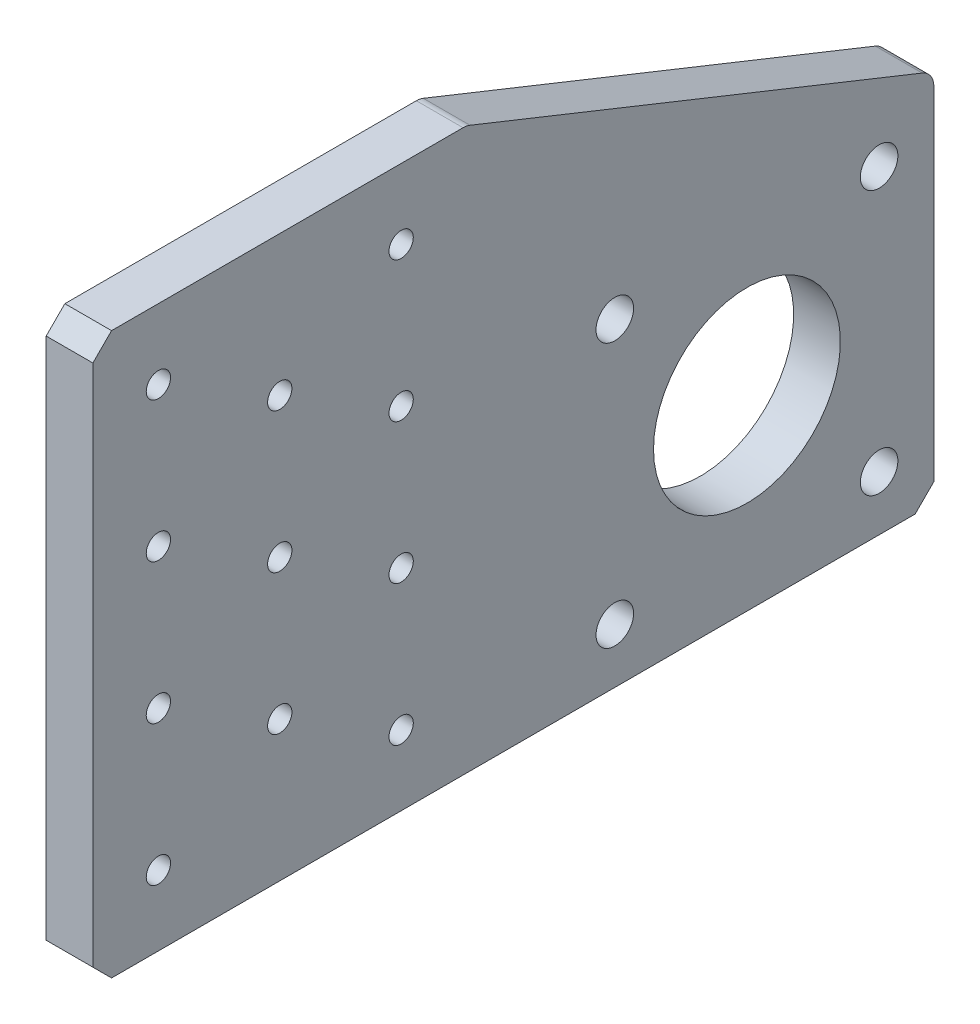
ISO-10303-21;
HEADER;
FILE_DESCRIPTION(('STEP AP214'),'2;1');
FILE_NAME('part.step','',(''),(''),'','','');
FILE_SCHEMA(('AUTOMOTIVE_DESIGN { 1 0 10303 214 1 1 1 1 }'));
ENDSEC;
DATA;
#1=APPLICATION_CONTEXT('core data for automotive mechanical design processes');
#2=APPLICATION_PROTOCOL_DEFINITION('international standard','automotive_design',2000,#1);
#3=PRODUCT_CONTEXT('',#1,'mechanical');
#4=PRODUCT('Part','Part','',(#3));
#5=PRODUCT_RELATED_PRODUCT_CATEGORY('part','',(#4));
#6=PRODUCT_DEFINITION_FORMATION('','',#4);
#7=PRODUCT_DEFINITION_CONTEXT('part definition',#1,'design');
#8=PRODUCT_DEFINITION('design','',#6,#7);
#9=PRODUCT_DEFINITION_SHAPE('','',#8);
#10=(LENGTH_UNIT() NAMED_UNIT(*) SI_UNIT(.MILLI.,.METRE.));
#11=(NAMED_UNIT(*) PLANE_ANGLE_UNIT() SI_UNIT($,.RADIAN.));
#12=(NAMED_UNIT(*) SI_UNIT($,.STERADIAN.) SOLID_ANGLE_UNIT());
#13=UNCERTAINTY_MEASURE_WITH_UNIT(LENGTH_MEASURE(1.E-05),#10,'distance_accuracy_value','');
#14=(GEOMETRIC_REPRESENTATION_CONTEXT(3) GLOBAL_UNCERTAINTY_ASSIGNED_CONTEXT((#13)) GLOBAL_UNIT_ASSIGNED_CONTEXT((#10,
#11,#12)) REPRESENTATION_CONTEXT('',''));
#15=CARTESIAN_POINT('',(0.,0.,0.));
#16=DIRECTION('',(0.,0.,1.));
#17=DIRECTION('',(1.,0.,0.));
#18=AXIS2_PLACEMENT_3D('',#15,#16,#17);
#19=CARTESIAN_POINT('',(0.,0.,0.));
#20=DIRECTION('',(1.,0.,0.));
#21=DIRECTION('',(0.,0.,-1.));
#22=AXIS2_PLACEMENT_3D('',#19,#20,#21);
#23=PLANE('',#22);
#24=CARTESIAN_POINT('',(0.,66.6749999999999,-41.8977839420936));
#25=DIRECTION('',(-1.,0.,0.));
#26=DIRECTION('',(0.,1.,0.));
#27=AXIS2_PLACEMENT_3D('',#24,#25,#26);
#28=CIRCLE('',#27,1.651);
#29=CARTESIAN_POINT('',(0.,68.3259999999999,-41.8977839420936));
#30=VERTEX_POINT('',#29);
#31=EDGE_CURVE('E686',#30,#30,#28,.T.);
#32=ORIENTED_EDGE('',*,*,#31,.F.);
#33=EDGE_LOOP('',(#32));
#34=FACE_BOUND('',#33,.T.);
#35=CARTESIAN_POINT('',(0.,66.6749999999999,-8.90221605790642));
#36=DIRECTION('',(-1.,0.,0.));
#37=DIRECTION('',(0.,1.,0.));
#38=AXIS2_PLACEMENT_3D('',#35,#36,#37);
#39=CIRCLE('',#38,1.651);
#40=CARTESIAN_POINT('',(0.,68.3259999999999,-8.90221605790642));
#41=VERTEX_POINT('',#40);
#42=EDGE_CURVE('E622',#41,#41,#39,.T.);
#43=ORIENTED_EDGE('',*,*,#42,.F.);
#44=EDGE_LOOP('',(#43));
#45=FACE_BOUND('',#44,.T.);
#46=CARTESIAN_POINT('',(0.,9.5250000000001,-8.90221605790642));
#47=DIRECTION('',(-1.,0.,0.));
#48=DIRECTION('',(0.,1.,0.));
#49=AXIS2_PLACEMENT_3D('',#46,#47,#48);
#50=CIRCLE('',#49,1.651);
#51=CARTESIAN_POINT('',(0.,11.1760000000001,-8.90221605790642));
#52=VERTEX_POINT('',#51);
#53=EDGE_CURVE('E693',#52,#52,#50,.T.);
#54=ORIENTED_EDGE('',*,*,#53,.F.);
#55=EDGE_LOOP('',(#54));
#56=FACE_BOUND('',#55,.T.);
#57=CARTESIAN_POINT('',(0.,28.575,-8.90221605790642));
#58=DIRECTION('',(-1.,0.,0.));
#59=DIRECTION('',(0.,1.,0.));
#60=AXIS2_PLACEMENT_3D('',#57,#58,#59);
#61=CIRCLE('',#60,1.651);
#62=CARTESIAN_POINT('',(0.,30.226,-8.90221605790642));
#63=VERTEX_POINT('',#62);
#64=EDGE_CURVE('E701',#63,#63,#61,.T.);
#65=ORIENTED_EDGE('',*,*,#64,.F.);
#66=EDGE_LOOP('',(#65));
#67=FACE_BOUND('',#66,.T.);
#68=CARTESIAN_POINT('',(0.,57.1499999999999,-25.4));
#69=DIRECTION('',(-1.,0.,0.));
#70=DIRECTION('',(0.,1.,0.));
#71=AXIS2_PLACEMENT_3D('',#68,#69,#70);
#72=CIRCLE('',#71,1.651);
#73=CARTESIAN_POINT('',(0.,58.8009999999999,-25.4));
#74=VERTEX_POINT('',#73);
#75=EDGE_CURVE('E639',#74,#74,#72,.T.);
#76=ORIENTED_EDGE('',*,*,#75,.F.);
#77=EDGE_LOOP('',(#76));
#78=FACE_BOUND('',#77,.T.);
#79=CARTESIAN_POINT('',(0.,38.1,-25.4));
#80=DIRECTION('',(-1.,0.,0.));
#81=DIRECTION('',(0.,1.,0.));
#82=AXIS2_PLACEMENT_3D('',#79,#80,#81);
#83=CIRCLE('',#82,1.651);
#84=CARTESIAN_POINT('',(0.,39.751,-25.4));
#85=VERTEX_POINT('',#84);
#86=EDGE_CURVE('E630',#85,#85,#83,.T.);
#87=ORIENTED_EDGE('',*,*,#86,.F.);
#88=EDGE_LOOP('',(#87));
#89=FACE_BOUND('',#88,.T.);
#90=CARTESIAN_POINT('',(0.,19.0500000000001,-25.4));
#91=DIRECTION('',(-1.,0.,0.));
#92=DIRECTION('',(0.,1.,0.));
#93=AXIS2_PLACEMENT_3D('',#90,#91,#92);
#94=CIRCLE('',#93,1.651);
#95=CARTESIAN_POINT('',(0.,20.7010000000001,-25.4));
#96=VERTEX_POINT('',#95);
#97=EDGE_CURVE('E657',#96,#96,#94,.T.);
#98=ORIENTED_EDGE('',*,*,#97,.F.);
#99=EDGE_LOOP('',(#98));
#100=FACE_BOUND('',#99,.T.);
#101=CARTESIAN_POINT('',(0.,47.625,-8.90221605790642));
#102=DIRECTION('',(-1.,0.,0.));
#103=DIRECTION('',(0.,1.,0.));
#104=AXIS2_PLACEMENT_3D('',#101,#102,#103);
#105=CIRCLE('',#104,1.651);
#106=CARTESIAN_POINT('',(0.,49.276,-8.90221605790642));
#107=VERTEX_POINT('',#106);
#108=EDGE_CURVE('E648',#107,#107,#105,.T.);
#109=ORIENTED_EDGE('',*,*,#108,.F.);
#110=EDGE_LOOP('',(#109));
#111=FACE_BOUND('',#110,.T.);
#112=CARTESIAN_POINT('',(0.,9.52500000000011,-41.8977839420936));
#113=DIRECTION('',(-1.,0.,0.));
#114=DIRECTION('',(0.,1.,0.));
#115=AXIS2_PLACEMENT_3D('',#112,#113,#114);
#116=CIRCLE('',#115,1.651);
#117=CARTESIAN_POINT('',(0.,11.1760000000001,-41.8977839420936));
#118=VERTEX_POINT('',#117);
#119=EDGE_CURVE('E647',#118,#118,#116,.T.);
#120=ORIENTED_EDGE('',*,*,#119,.F.);
#121=EDGE_LOOP('',(#120));
#122=FACE_BOUND('',#121,.T.);
#123=CARTESIAN_POINT('',(0.,28.575,-41.8977839420936));
#124=DIRECTION('',(-1.,0.,0.));
#125=DIRECTION('',(0.,1.,0.));
#126=AXIS2_PLACEMENT_3D('',#123,#124,#125);
#127=CIRCLE('',#126,1.651);
#128=CARTESIAN_POINT('',(0.,30.226,-41.8977839420936));
#129=VERTEX_POINT('',#128);
#130=EDGE_CURVE('E671',#129,#129,#127,.T.);
#131=ORIENTED_EDGE('',*,*,#130,.F.);
#132=EDGE_LOOP('',(#131));
#133=FACE_BOUND('',#132,.T.);
#134=CARTESIAN_POINT('',(0.,47.625,-41.8977839420936));
#135=DIRECTION('',(-1.,0.,0.));
#136=DIRECTION('',(0.,1.,0.));
#137=AXIS2_PLACEMENT_3D('',#134,#135,#136);
#138=CIRCLE('',#137,1.651);
#139=CARTESIAN_POINT('',(0.,49.276,-41.8977839420936));
#140=VERTEX_POINT('',#139);
#141=EDGE_CURVE('E679',#140,#140,#138,.T.);
#142=ORIENTED_EDGE('',*,*,#141,.F.);
#143=EDGE_LOOP('',(#142));
#144=FACE_BOUND('',#143,.T.);
#145=CARTESIAN_POINT('',(0.,25.4,-88.9));
#146=DIRECTION('',(-1.,0.,0.));
#147=DIRECTION('',(0.,0.,1.));
#148=AXIS2_PLACEMENT_3D('',#145,#146,#147);
#149=CIRCLE('',#148,12.7);
#150=CARTESIAN_POINT('',(0.,25.4,-76.2));
#151=VERTEX_POINT('',#150);
#152=EDGE_CURVE('E269',#151,#151,#149,.T.);
#153=ORIENTED_EDGE('',*,*,#152,.F.);
#154=EDGE_LOOP('',(#153));
#155=FACE_BOUND('',#154,.T.);
#156=CARTESIAN_POINT('',(0.,7.43948775786169,-70.9394877578617));
#157=DIRECTION('',(-1.,0.,0.));
#158=DIRECTION('',(0.,0.,1.));
#159=AXIS2_PLACEMENT_3D('',#156,#157,#158);
#160=CIRCLE('',#159,2.55269999999999);
#161=CARTESIAN_POINT('',(0.,7.43948775786169,-68.3867877578617));
#162=VERTEX_POINT('',#161);
#163=EDGE_CURVE('E248',#162,#162,#160,.T.);
#164=ORIENTED_EDGE('',*,*,#163,.F.);
#165=EDGE_LOOP('',(#164));
#166=FACE_BOUND('',#165,.T.);
#167=CARTESIAN_POINT('',(0.,43.3605122421383,-106.860512242138));
#168=DIRECTION('',(-1.,0.,0.));
#169=DIRECTION('',(0.,0.,1.));
#170=AXIS2_PLACEMENT_3D('',#167,#168,#169);
#171=CIRCLE('',#170,2.55269999999998);
#172=CARTESIAN_POINT('',(0.,43.3605122421383,-104.307812242138));
#173=VERTEX_POINT('',#172);
#174=EDGE_CURVE('E249',#173,#173,#171,.T.);
#175=ORIENTED_EDGE('',*,*,#174,.F.);
#176=EDGE_LOOP('',(#175));
#177=FACE_BOUND('',#176,.T.);
#178=CARTESIAN_POINT('',(0.,7.43948775786169,-106.860512242138));
#179=DIRECTION('',(-1.,0.,0.));
#180=DIRECTION('',(0.,0.,1.));
#181=AXIS2_PLACEMENT_3D('',#178,#179,#180);
#182=CIRCLE('',#181,2.55269999999999);
#183=CARTESIAN_POINT('',(0.,7.43948775786169,-104.307812242138));
#184=VERTEX_POINT('',#183);
#185=EDGE_CURVE('E258',#184,#184,#182,.T.);
#186=ORIENTED_EDGE('',*,*,#185,.F.);
#187=EDGE_LOOP('',(#186));
#188=FACE_BOUND('',#187,.T.);
#189=CARTESIAN_POINT('',(0.,43.3605122421383,-70.9394877578617));
#190=DIRECTION('',(-1.,0.,0.));
#191=DIRECTION('',(0.,0.,1.));
#192=AXIS2_PLACEMENT_3D('',#189,#190,#191);
#193=CIRCLE('',#192,2.55269999999999);
#194=CARTESIAN_POINT('',(0.,43.3605122421383,-68.3867877578617));
#195=VERTEX_POINT('',#194);
#196=EDGE_CURVE('E609',#195,#195,#193,.T.);
#197=ORIENTED_EDGE('',*,*,#196,.F.);
#198=EDGE_LOOP('',(#197));
#199=FACE_BOUND('',#198,.T.);
#200=DIRECTION('',(0.,1.,0.));
#201=VECTOR('',#200,1.);
#202=CARTESIAN_POINT('',(0.,0.,-114.3));
#203=LINE('',#202,#201);
#204=CARTESIAN_POINT('',(0.,2.54000000000001,-114.3));
#205=VERTEX_POINT('',#204);
#206=CARTESIAN_POINT('',(0.,49.0803362779757,-114.3));
#207=VERTEX_POINT('',#206);
#208=EDGE_CURVE('E180',#205,#207,#203,.T.);
#209=ORIENTED_EDGE('',*,*,#208,.F.);
#210=DIRECTION('',(0.,0.707106781186546,-0.707106781186549));
#211=VECTOR('',#210,1.);
#212=CARTESIAN_POINT('',(0.,2.54000000000001,-114.3));
#213=LINE('',#212,#211);
#214=CARTESIAN_POINT('',(0.,0.,-111.76));
#215=VERTEX_POINT('',#214);
#216=EDGE_CURVE('E218',#205,#215,#213,.F.);
#217=ORIENTED_EDGE('',*,*,#216,.T.);
#218=DIRECTION('',(0.,0.,-1.));
#219=VECTOR('',#218,1.);
#220=CARTESIAN_POINT('',(0.,0.,0.));
#221=LINE('',#220,#219);
#222=CARTESIAN_POINT('',(0.,0.,-2.54000000000001));
#223=VERTEX_POINT('',#222);
#224=EDGE_CURVE('E189',#223,#215,#221,.T.);
#225=ORIENTED_EDGE('',*,*,#224,.F.);
#226=DIRECTION('',(0.,-0.707106781186549,-0.707106781186546));
#227=VECTOR('',#226,1.);
#228=CARTESIAN_POINT('',(0.,0.,-2.54000000000001));
#229=LINE('',#228,#227);
#230=CARTESIAN_POINT('',(0.,2.54000000000006,0.));
#231=VERTEX_POINT('',#230);
#232=EDGE_CURVE('E215',#223,#231,#229,.F.);
#233=ORIENTED_EDGE('',*,*,#232,.T.);
#234=DIRECTION('',(0.,-1.,0.));
#235=VECTOR('',#234,1.);
#236=CARTESIAN_POINT('',(0.,76.2,0.));
#237=LINE('',#236,#235);
#238=CARTESIAN_POINT('',(0.,73.66,0.));
#239=VERTEX_POINT('',#238);
#240=EDGE_CURVE('E274',#239,#231,#237,.T.);
#241=ORIENTED_EDGE('',*,*,#240,.F.);
#242=DIRECTION('',(0.,-0.707106781186544,0.707106781186551));
#243=VECTOR('',#242,1.);
#244=CARTESIAN_POINT('',(0.,73.66,0.));
#245=LINE('',#244,#243);
#246=CARTESIAN_POINT('',(0.,76.2,-2.54));
#247=VERTEX_POINT('',#246);
#248=EDGE_CURVE('E212',#239,#247,#245,.F.);
#249=ORIENTED_EDGE('',*,*,#248,.T.);
#250=DIRECTION('',(0.,0.,1.));
#251=VECTOR('',#250,1.);
#252=CARTESIAN_POINT('',(0.,76.2,-50.8));
#253=LINE('',#252,#251);
#254=CARTESIAN_POINT('',(0.,76.2,-50.3108406949392));
#255=VERTEX_POINT('',#254);
#256=EDGE_CURVE('E179',#255,#247,#253,.T.);
#257=ORIENTED_EDGE('',*,*,#256,.F.);
#258=CARTESIAN_POINT('',(0.,73.66,-50.3108406949392));
#259=DIRECTION('',(1.,0.,0.));
#260=DIRECTION('',(0.,0.,-1.));
#261=AXIS2_PLACEMENT_3D('',#258,#259,#260);
#262=CIRCLE('',#261,2.54);
#263=CARTESIAN_POINT('',(0.,76.0183307948485,-51.2541730128786));
#264=VERTEX_POINT('',#263);
#265=EDGE_CURVE('E164',#255,#264,#262,.F.);
#266=ORIENTED_EDGE('',*,*,#265,.T.);
#267=DIRECTION('',(0.,0.371390676354103,0.928476690885259));
#268=VECTOR('',#267,1.);
#269=CARTESIAN_POINT('',(0.,50.8,-114.3));
#270=LINE('',#269,#268);
#271=CARTESIAN_POINT('',(0.,51.4386670728242,-112.703332317939));
#272=VERTEX_POINT('',#271);
#273=EDGE_CURVE('E170',#272,#264,#270,.T.);
#274=ORIENTED_EDGE('',*,*,#273,.F.);
#275=CARTESIAN_POINT('',(0.,49.0803362779757,-111.76));
#276=DIRECTION('',(1.,0.,0.));
#277=DIRECTION('',(0.,0.,-1.));
#278=AXIS2_PLACEMENT_3D('',#275,#276,#277);
#279=CIRCLE('',#278,2.54);
#280=EDGE_CURVE('E153',#272,#207,#279,.F.);
#281=ORIENTED_EDGE('',*,*,#280,.T.);
#282=EDGE_LOOP('',(#209,#217,#225,#233,#241,#249,#257,#266,#274,#281));
#283=FACE_BOUND('',#282,.T.);
#284=ADVANCED_FACE('F53',(#34,#45,#56,#67,#78,#89,#100,#111,#122,#133,#144,#155,#166,#177,#188,
#199,#283),#23,.F.);
#285=CARTESIAN_POINT('',(6.35,76.2,0.));
#286=DIRECTION('',(0.,0.,-1.));
#287=DIRECTION('',(0.,1.,0.));
#288=AXIS2_PLACEMENT_3D('',#285,#286,#287);
#289=PLANE('',#288);
#290=ORIENTED_EDGE('',*,*,#240,.T.);
#291=DIRECTION('',(1.,0.,0.));
#292=VECTOR('',#291,1.);
#293=CARTESIAN_POINT('',(6.35,2.54000000000003,0.));
#294=LINE('',#293,#292);
#295=CARTESIAN_POINT('',(6.35,2.54000000000006,0.));
#296=VERTEX_POINT('',#295);
#297=EDGE_CURVE('E63',#231,#296,#294,.T.);
#298=ORIENTED_EDGE('',*,*,#297,.T.);
#299=DIRECTION('',(0.,-1.,0.));
#300=VECTOR('',#299,1.);
#301=CARTESIAN_POINT('',(6.35,76.2,0.));
#302=LINE('',#301,#300);
#303=CARTESIAN_POINT('',(6.35,73.66,0.));
#304=VERTEX_POINT('',#303);
#305=EDGE_CURVE('E186',#304,#296,#302,.T.);
#306=ORIENTED_EDGE('',*,*,#305,.F.);
#307=DIRECTION('',(-1.,0.,0.));
#308=VECTOR('',#307,1.);
#309=CARTESIAN_POINT('',(6.35,73.66,0.));
#310=LINE('',#309,#308);
#311=EDGE_CURVE('E236',#304,#239,#310,.T.);
#312=ORIENTED_EDGE('',*,*,#311,.T.);
#313=EDGE_LOOP('',(#290,#298,#306,#312));
#314=FACE_BOUND('',#313,.T.);
#315=ADVANCED_FACE('F316',(#314),#289,.F.);
#316=CARTESIAN_POINT('',(6.35,0.,0.));
#317=DIRECTION('',(0.,1.,0.));
#318=DIRECTION('',(0.,0.,1.));
#319=AXIS2_PLACEMENT_3D('',#316,#317,#318);
#320=PLANE('',#319);
#321=ORIENTED_EDGE('',*,*,#224,.T.);
#322=DIRECTION('',(1.,0.,0.));
#323=VECTOR('',#322,1.);
#324=CARTESIAN_POINT('',(6.35,0.,-111.76));
#325=LINE('',#324,#323);
#326=CARTESIAN_POINT('',(6.35,0.,-111.76));
#327=VERTEX_POINT('',#326);
#328=EDGE_CURVE('E225',#215,#327,#325,.T.);
#329=ORIENTED_EDGE('',*,*,#328,.T.);
#330=DIRECTION('',(0.,0.,-1.));
#331=VECTOR('',#330,1.);
#332=CARTESIAN_POINT('',(6.35,0.,0.));
#333=LINE('',#332,#331);
#334=CARTESIAN_POINT('',(6.35,0.,-2.54000000000001));
#335=VERTEX_POINT('',#334);
#336=EDGE_CURVE('E243',#335,#327,#333,.T.);
#337=ORIENTED_EDGE('',*,*,#336,.F.);
#338=DIRECTION('',(-1.,0.,0.));
#339=VECTOR('',#338,1.);
#340=CARTESIAN_POINT('',(6.35,0.,-2.54000000000001));
#341=LINE('',#340,#339);
#342=EDGE_CURVE('E221',#335,#223,#341,.T.);
#343=ORIENTED_EDGE('',*,*,#342,.T.);
#344=EDGE_LOOP('',(#321,#329,#337,#343));
#345=FACE_BOUND('',#344,.T.);
#346=ADVANCED_FACE('F294',(#345),#320,.F.);
#347=CARTESIAN_POINT('',(6.35,0.,-114.3));
#348=DIRECTION('',(0.,0.,1.));
#349=DIRECTION('',(1.,0.,0.));
#350=AXIS2_PLACEMENT_3D('',#347,#348,#349);
#351=PLANE('',#350);
#352=DIRECTION('',(0.,1.,0.));
#353=VECTOR('',#352,1.);
#354=CARTESIAN_POINT('',(6.35,0.,-114.3));
#355=LINE('',#354,#353);
#356=CARTESIAN_POINT('',(6.35,2.54000000000001,-114.3));
#357=VERTEX_POINT('',#356);
#358=CARTESIAN_POINT('',(6.35,49.0803362779757,-114.3));
#359=VERTEX_POINT('',#358);
#360=EDGE_CURVE('E241',#357,#359,#355,.T.);
#361=ORIENTED_EDGE('',*,*,#360,.F.);
#362=DIRECTION('',(-1.,0.,0.));
#363=VECTOR('',#362,1.);
#364=CARTESIAN_POINT('',(6.35,2.54000000000001,-114.3));
#365=LINE('',#364,#363);
#366=EDGE_CURVE('E208',#357,#205,#365,.T.);
#367=ORIENTED_EDGE('',*,*,#366,.T.);
#368=ORIENTED_EDGE('',*,*,#208,.T.);
#369=DIRECTION('',(-1.,0.,0.));
#370=VECTOR('',#369,1.);
#371=CARTESIAN_POINT('',(6.35,49.0803362779757,-114.3));
#372=LINE('',#371,#370);
#373=EDGE_CURVE('E159',#207,#359,#372,.F.);
#374=ORIENTED_EDGE('',*,*,#373,.T.);
#375=EDGE_LOOP('',(#361,#367,#368,#374));
#376=FACE_BOUND('',#375,.T.);
#377=ADVANCED_FACE('F304',(#376),#351,.F.);
#378=CARTESIAN_POINT('',(6.35,50.8,-114.3));
#379=DIRECTION('',(0.,-0.928476690885259,0.371390676354103));
#380=DIRECTION('',(0.,-0.371390676354103,-0.92847669088526));
#381=AXIS2_PLACEMENT_3D('',#378,#379,#380);
#382=PLANE('',#381);
#383=DIRECTION('',(0.,0.371390676354103,0.928476690885259));
#384=VECTOR('',#383,1.);
#385=CARTESIAN_POINT('',(6.35,50.8,-114.3));
#386=LINE('',#385,#384);
#387=CARTESIAN_POINT('',(6.35,51.4386670728242,-112.703332317939));
#388=VERTEX_POINT('',#387);
#389=CARTESIAN_POINT('',(6.35,76.0183307948485,-51.2541730128786));
#390=VERTEX_POINT('',#389);
#391=EDGE_CURVE('E173',#388,#390,#386,.T.);
#392=ORIENTED_EDGE('',*,*,#391,.F.);
#393=DIRECTION('',(-1.,0.,0.));
#394=VECTOR('',#393,1.);
#395=CARTESIAN_POINT('',(6.35,51.4386670728242,-112.703332317939));
#396=LINE('',#395,#394);
#397=EDGE_CURVE('E157',#388,#272,#396,.T.);
#398=ORIENTED_EDGE('',*,*,#397,.T.);
#399=ORIENTED_EDGE('',*,*,#273,.T.);
#400=DIRECTION('',(-1.,0.,0.));
#401=VECTOR('',#400,1.);
#402=CARTESIAN_POINT('',(6.35,76.0183307948485,-51.2541730128786));
#403=LINE('',#402,#401);
#404=EDGE_CURVE('E175',#264,#390,#403,.F.);
#405=ORIENTED_EDGE('',*,*,#404,.T.);
#406=EDGE_LOOP('',(#392,#398,#399,#405));
#407=FACE_BOUND('',#406,.T.);
#408=ADVANCED_FACE('F169',(#407),#382,.F.);
#409=CARTESIAN_POINT('',(6.35,76.2,-50.8));
#410=DIRECTION('',(0.,-1.,0.));
#411=DIRECTION('',(0.,0.,-1.));
#412=AXIS2_PLACEMENT_3D('',#409,#410,#411);
#413=PLANE('',#412);
#414=ORIENTED_EDGE('',*,*,#256,.T.);
#415=DIRECTION('',(1.,0.,0.));
#416=VECTOR('',#415,1.);
#417=CARTESIAN_POINT('',(6.35,76.2,-2.54));
#418=LINE('',#417,#416);
#419=CARTESIAN_POINT('',(6.35,76.2,-2.54));
#420=VERTEX_POINT('',#419);
#421=EDGE_CURVE('E12',#247,#420,#418,.T.);
#422=ORIENTED_EDGE('',*,*,#421,.T.);
#423=DIRECTION('',(0.,0.,1.));
#424=VECTOR('',#423,1.);
#425=CARTESIAN_POINT('',(6.35,76.2,-50.8));
#426=LINE('',#425,#424);
#427=CARTESIAN_POINT('',(6.35,76.2,-50.3108406949392));
#428=VERTEX_POINT('',#427);
#429=EDGE_CURVE('E193',#428,#420,#426,.T.);
#430=ORIENTED_EDGE('',*,*,#429,.F.);
#431=DIRECTION('',(-1.,0.,0.));
#432=VECTOR('',#431,1.);
#433=CARTESIAN_POINT('',(6.35,76.2,-50.3108406949392));
#434=LINE('',#433,#432);
#435=EDGE_CURVE('E204',#428,#255,#434,.T.);
#436=ORIENTED_EDGE('',*,*,#435,.T.);
#437=EDGE_LOOP('',(#414,#422,#430,#436));
#438=FACE_BOUND('',#437,.T.);
#439=ADVANCED_FACE('F311',(#438),#413,.F.);
#440=CARTESIAN_POINT('',(6.35,0.,0.));
#441=DIRECTION('',(1.,0.,0.));
#442=DIRECTION('',(0.,0.,-1.));
#443=AXIS2_PLACEMENT_3D('',#440,#441,#442);
#444=PLANE('',#443);
#445=CARTESIAN_POINT('',(6.35,66.6749999999999,-41.8977839420936));
#446=DIRECTION('',(-1.,0.,0.));
#447=DIRECTION('',(0.,1.,0.));
#448=AXIS2_PLACEMENT_3D('',#445,#446,#447);
#449=CIRCLE('',#448,1.651);
#450=CARTESIAN_POINT('',(6.35,68.3259999999999,-41.8977839420936));
#451=VERTEX_POINT('',#450);
#452=EDGE_CURVE('E628',#451,#451,#449,.T.);
#453=ORIENTED_EDGE('',*,*,#452,.T.);
#454=EDGE_LOOP('',(#453));
#455=FACE_BOUND('',#454,.T.);
#456=CARTESIAN_POINT('',(6.35,47.625,-41.8977839420936));
#457=DIRECTION('',(-1.,0.,0.));
#458=DIRECTION('',(0.,1.,0.));
#459=AXIS2_PLACEMENT_3D('',#456,#457,#458);
#460=CIRCLE('',#459,1.651);
#461=CARTESIAN_POINT('',(6.35,49.276,-41.8977839420936));
#462=VERTEX_POINT('',#461);
#463=EDGE_CURVE('E682',#462,#462,#460,.T.);
#464=ORIENTED_EDGE('',*,*,#463,.T.);
#465=EDGE_LOOP('',(#464));
#466=FACE_BOUND('',#465,.T.);
#467=CARTESIAN_POINT('',(6.35,28.575,-41.8977839420936));
#468=DIRECTION('',(-1.,0.,0.));
#469=DIRECTION('',(0.,1.,0.));
#470=AXIS2_PLACEMENT_3D('',#467,#468,#469);
#471=CIRCLE('',#470,1.651);
#472=CARTESIAN_POINT('',(6.35,30.226,-41.8977839420936));
#473=VERTEX_POINT('',#472);
#474=EDGE_CURVE('E675',#473,#473,#471,.T.);
#475=ORIENTED_EDGE('',*,*,#474,.T.);
#476=EDGE_LOOP('',(#475));
#477=FACE_BOUND('',#476,.T.);
#478=CARTESIAN_POINT('',(6.35,9.52500000000011,-41.8977839420936));
#479=DIRECTION('',(-1.,0.,0.));
#480=DIRECTION('',(0.,1.,0.));
#481=AXIS2_PLACEMENT_3D('',#478,#479,#480);
#482=CIRCLE('',#481,1.651);
#483=CARTESIAN_POINT('',(6.35,11.1760000000001,-41.8977839420936));
#484=VERTEX_POINT('',#483);
#485=EDGE_CURVE('E667',#484,#484,#482,.T.);
#486=ORIENTED_EDGE('',*,*,#485,.T.);
#487=EDGE_LOOP('',(#486));
#488=FACE_BOUND('',#487,.T.);
#489=CARTESIAN_POINT('',(6.35,47.625,-8.90221605790642));
#490=DIRECTION('',(-1.,0.,0.));
#491=DIRECTION('',(0.,1.,0.));
#492=AXIS2_PLACEMENT_3D('',#489,#490,#491);
#493=CIRCLE('',#492,1.651);
#494=CARTESIAN_POINT('',(6.35,49.276,-8.90221605790642));
#495=VERTEX_POINT('',#494);
#496=EDGE_CURVE('E652',#495,#495,#493,.T.);
#497=ORIENTED_EDGE('',*,*,#496,.T.);
#498=EDGE_LOOP('',(#497));
#499=FACE_BOUND('',#498,.T.);
#500=CARTESIAN_POINT('',(6.35,19.0500000000001,-25.4));
#501=DIRECTION('',(-1.,0.,0.));
#502=DIRECTION('',(0.,1.,0.));
#503=AXIS2_PLACEMENT_3D('',#500,#501,#502);
#504=CIRCLE('',#503,1.651);
#505=CARTESIAN_POINT('',(6.35,20.7010000000001,-25.4));
#506=VERTEX_POINT('',#505);
#507=EDGE_CURVE('E635',#506,#506,#504,.T.);
#508=ORIENTED_EDGE('',*,*,#507,.T.);
#509=EDGE_LOOP('',(#508));
#510=FACE_BOUND('',#509,.T.);
#511=CARTESIAN_POINT('',(6.35,38.1,-25.4));
#512=DIRECTION('',(-1.,0.,0.));
#513=DIRECTION('',(0.,1.,0.));
#514=AXIS2_PLACEMENT_3D('',#511,#512,#513);
#515=CIRCLE('',#514,1.651);
#516=CARTESIAN_POINT('',(6.35,39.751,-25.4));
#517=VERTEX_POINT('',#516);
#518=EDGE_CURVE('E634',#517,#517,#515,.T.);
#519=ORIENTED_EDGE('',*,*,#518,.T.);
#520=EDGE_LOOP('',(#519));
#521=FACE_BOUND('',#520,.T.);
#522=CARTESIAN_POINT('',(6.35,57.1499999999999,-25.4));
#523=DIRECTION('',(-1.,0.,0.));
#524=DIRECTION('',(0.,1.,0.));
#525=AXIS2_PLACEMENT_3D('',#522,#523,#524);
#526=CIRCLE('',#525,1.651);
#527=CARTESIAN_POINT('',(6.35,58.8009999999999,-25.4));
#528=VERTEX_POINT('',#527);
#529=EDGE_CURVE('E643',#528,#528,#526,.T.);
#530=ORIENTED_EDGE('',*,*,#529,.T.);
#531=EDGE_LOOP('',(#530));
#532=FACE_BOUND('',#531,.T.);
#533=CARTESIAN_POINT('',(6.35,28.575,-8.90221605790642));
#534=DIRECTION('',(-1.,0.,0.));
#535=DIRECTION('',(0.,1.,0.));
#536=AXIS2_PLACEMENT_3D('',#533,#534,#535);
#537=CIRCLE('',#536,1.651);
#538=CARTESIAN_POINT('',(6.35,30.226,-8.90221605790642));
#539=VERTEX_POINT('',#538);
#540=EDGE_CURVE('E653',#539,#539,#537,.T.);
#541=ORIENTED_EDGE('',*,*,#540,.T.);
#542=EDGE_LOOP('',(#541));
#543=FACE_BOUND('',#542,.T.);
#544=CARTESIAN_POINT('',(6.35,9.5250000000001,-8.90221605790642));
#545=DIRECTION('',(-1.,0.,0.));
#546=DIRECTION('',(0.,1.,0.));
#547=AXIS2_PLACEMENT_3D('',#544,#545,#546);
#548=CIRCLE('',#547,1.651);
#549=CARTESIAN_POINT('',(6.35,11.1760000000001,-8.90221605790642));
#550=VERTEX_POINT('',#549);
#551=EDGE_CURVE('E697',#550,#550,#548,.T.);
#552=ORIENTED_EDGE('',*,*,#551,.T.);
#553=EDGE_LOOP('',(#552));
#554=FACE_BOUND('',#553,.T.);
#555=CARTESIAN_POINT('',(6.35,66.6749999999999,-8.90221605790642));
#556=DIRECTION('',(-1.,0.,0.));
#557=DIRECTION('',(0.,1.,0.));
#558=AXIS2_PLACEMENT_3D('',#555,#556,#557);
#559=CIRCLE('',#558,1.651);
#560=CARTESIAN_POINT('',(6.35,68.3259999999999,-8.90221605790642));
#561=VERTEX_POINT('',#560);
#562=EDGE_CURVE('E613',#561,#561,#559,.T.);
#563=ORIENTED_EDGE('',*,*,#562,.T.);
#564=EDGE_LOOP('',(#563));
#565=FACE_BOUND('',#564,.T.);
#566=CARTESIAN_POINT('',(6.34999999999999,43.3605122421383,-70.9394877578617));
#567=DIRECTION('',(-1.,0.,0.));
#568=DIRECTION('',(0.,0.,1.));
#569=AXIS2_PLACEMENT_3D('',#566,#567,#568);
#570=CIRCLE('',#569,2.55269999999998);
#571=CARTESIAN_POINT('',(6.34999999999999,43.3605122421383,-68.3867877578617));
#572=VERTEX_POINT('',#571);
#573=EDGE_CURVE('E612',#572,#572,#570,.T.);
#574=ORIENTED_EDGE('',*,*,#573,.T.);
#575=EDGE_LOOP('',(#574));
#576=FACE_BOUND('',#575,.T.);
#577=CARTESIAN_POINT('',(6.34999999999999,7.43948775786169,-106.860512242138));
#578=DIRECTION('',(-1.,0.,0.));
#579=DIRECTION('',(0.,0.,1.));
#580=AXIS2_PLACEMENT_3D('',#577,#578,#579);
#581=CIRCLE('',#580,2.55269999999999);
#582=CARTESIAN_POINT('',(6.34999999999999,7.43948775786169,-104.307812242138));
#583=VERTEX_POINT('',#582);
#584=EDGE_CURVE('E252',#583,#583,#581,.T.);
#585=ORIENTED_EDGE('',*,*,#584,.T.);
#586=EDGE_LOOP('',(#585));
#587=FACE_BOUND('',#586,.T.);
#588=CARTESIAN_POINT('',(6.34999999999999,43.3605122421383,-106.860512242138));
#589=DIRECTION('',(-1.,0.,0.));
#590=DIRECTION('',(0.,0.,1.));
#591=AXIS2_PLACEMENT_3D('',#588,#589,#590);
#592=CIRCLE('',#591,2.55269999999998);
#593=CARTESIAN_POINT('',(6.34999999999999,43.3605122421383,-104.307812242138));
#594=VERTEX_POINT('',#593);
#595=EDGE_CURVE('E245',#594,#594,#592,.T.);
#596=ORIENTED_EDGE('',*,*,#595,.T.);
#597=EDGE_LOOP('',(#596));
#598=FACE_BOUND('',#597,.T.);
#599=CARTESIAN_POINT('',(6.34999999999999,7.43948775786169,-70.9394877578617));
#600=DIRECTION('',(-1.,0.,0.));
#601=DIRECTION('',(0.,0.,1.));
#602=AXIS2_PLACEMENT_3D('',#599,#600,#601);
#603=CIRCLE('',#602,2.55269999999999);
#604=CARTESIAN_POINT('',(6.34999999999999,7.43948775786169,-68.3867877578617));
#605=VERTEX_POINT('',#604);
#606=EDGE_CURVE('E265',#605,#605,#603,.T.);
#607=ORIENTED_EDGE('',*,*,#606,.T.);
#608=EDGE_LOOP('',(#607));
#609=FACE_BOUND('',#608,.T.);
#610=CARTESIAN_POINT('',(6.35,25.4,-88.9));
#611=DIRECTION('',(-1.,0.,0.));
#612=DIRECTION('',(0.,0.,1.));
#613=AXIS2_PLACEMENT_3D('',#610,#611,#612);
#614=CIRCLE('',#613,12.7);
#615=CARTESIAN_POINT('',(6.35,25.4,-76.2));
#616=VERTEX_POINT('',#615);
#617=EDGE_CURVE('E270',#616,#616,#614,.T.);
#618=ORIENTED_EDGE('',*,*,#617,.T.);
#619=EDGE_LOOP('',(#618));
#620=FACE_BOUND('',#619,.T.);
#621=ORIENTED_EDGE('',*,*,#336,.T.);
#622=DIRECTION('',(0.,-0.707106781186546,0.707106781186549));
#623=VECTOR('',#622,1.);
#624=CARTESIAN_POINT('',(6.35,-55.88,-55.8799999999997));
#625=LINE('',#624,#623);
#626=EDGE_CURVE('E233',#327,#357,#625,.F.);
#627=ORIENTED_EDGE('',*,*,#626,.T.);
#628=ORIENTED_EDGE('',*,*,#360,.T.);
#629=CARTESIAN_POINT('',(6.35,49.0803362779757,-111.76));
#630=DIRECTION('',(1.,0.,0.));
#631=DIRECTION('',(0.,0.,-1.));
#632=AXIS2_PLACEMENT_3D('',#629,#630,#631);
#633=CIRCLE('',#632,2.54);
#634=EDGE_CURVE('E201',#359,#388,#633,.T.);
#635=ORIENTED_EDGE('',*,*,#634,.T.);
#636=ORIENTED_EDGE('',*,*,#391,.T.);
#637=CARTESIAN_POINT('',(6.35,73.66,-50.3108406949392));
#638=DIRECTION('',(1.,0.,0.));
#639=DIRECTION('',(0.,0.,-1.));
#640=AXIS2_PLACEMENT_3D('',#637,#638,#639);
#641=CIRCLE('',#640,2.54);
#642=EDGE_CURVE('E198',#390,#428,#641,.T.);
#643=ORIENTED_EDGE('',*,*,#642,.T.);
#644=ORIENTED_EDGE('',*,*,#429,.T.);
#645=DIRECTION('',(0.,0.707106781186544,-0.707106781186551));
#646=VECTOR('',#645,1.);
#647=CARTESIAN_POINT('',(6.35,36.8300000000004,36.83));
#648=LINE('',#647,#646);
#649=EDGE_CURVE('E82',#420,#304,#648,.F.);
#650=ORIENTED_EDGE('',*,*,#649,.T.);
#651=ORIENTED_EDGE('',*,*,#305,.T.);
#652=DIRECTION('',(0.,0.707106781186549,0.707106781186546));
#653=VECTOR('',#652,1.);
#654=CARTESIAN_POINT('',(6.35,1.27000000000001,-1.27000000000001));
#655=LINE('',#654,#653);
#656=EDGE_CURVE('E230',#296,#335,#655,.F.);
#657=ORIENTED_EDGE('',*,*,#656,.T.);
#658=EDGE_LOOP('',(#621,#627,#628,#635,#636,#643,#644,#650,#651,#657));
#659=FACE_BOUND('',#658,.T.);
#660=ADVANCED_FACE('F302',(#455,#466,#477,#488,#499,#510,#521,#532,#543,#554,#565,#576,#587,
#598,#609,#620,#659),#444,.T.);
#661=CARTESIAN_POINT('',(6.35,25.4,-88.9));
#662=DIRECTION('',(-1.,0.,0.));
#663=DIRECTION('',(0.,0.,1.));
#664=AXIS2_PLACEMENT_3D('',#661,#662,#663);
#665=CYLINDRICAL_SURFACE('',#664,12.7);
#666=ORIENTED_EDGE('',*,*,#617,.F.);
#667=EDGE_LOOP('',(#666));
#668=FACE_BOUND('',#667,.T.);
#669=ORIENTED_EDGE('',*,*,#152,.T.);
#670=EDGE_LOOP('',(#669));
#671=FACE_BOUND('',#670,.T.);
#672=ADVANCED_FACE('F400',(#668,#671),#665,.F.);
#673=CARTESIAN_POINT('',(0.,7.43948775786169,-70.9394877578617));
#674=DIRECTION('',(-1.,0.,0.));
#675=DIRECTION('',(0.,0.,1.));
#676=AXIS2_PLACEMENT_3D('',#673,#674,#675);
#677=CYLINDRICAL_SURFACE('',#676,2.55269999999999);
#678=ORIENTED_EDGE('',*,*,#606,.F.);
#679=EDGE_LOOP('',(#678));
#680=FACE_BOUND('',#679,.T.);
#681=ORIENTED_EDGE('',*,*,#163,.T.);
#682=EDGE_LOOP('',(#681));
#683=FACE_BOUND('',#682,.T.);
#684=ADVANCED_FACE('F528',(#680,#683),#677,.F.);
#685=CARTESIAN_POINT('',(0.,43.3605122421383,-106.860512242138));
#686=DIRECTION('',(-1.,0.,0.));
#687=DIRECTION('',(0.,0.,1.));
#688=AXIS2_PLACEMENT_3D('',#685,#686,#687);
#689=CYLINDRICAL_SURFACE('',#688,2.55269999999998);
#690=ORIENTED_EDGE('',*,*,#595,.F.);
#691=EDGE_LOOP('',(#690));
#692=FACE_BOUND('',#691,.T.);
#693=ORIENTED_EDGE('',*,*,#174,.T.);
#694=EDGE_LOOP('',(#693));
#695=FACE_BOUND('',#694,.T.);
#696=ADVANCED_FACE('F560',(#692,#695),#689,.F.);
#697=CARTESIAN_POINT('',(0.,7.43948775786169,-106.860512242138));
#698=DIRECTION('',(-1.,0.,0.));
#699=DIRECTION('',(0.,0.,1.));
#700=AXIS2_PLACEMENT_3D('',#697,#698,#699);
#701=CYLINDRICAL_SURFACE('',#700,2.55269999999999);
#702=ORIENTED_EDGE('',*,*,#584,.F.);
#703=EDGE_LOOP('',(#702));
#704=FACE_BOUND('',#703,.T.);
#705=ORIENTED_EDGE('',*,*,#185,.T.);
#706=EDGE_LOOP('',(#705));
#707=FACE_BOUND('',#706,.T.);
#708=ADVANCED_FACE('F550',(#704,#707),#701,.F.);
#709=CARTESIAN_POINT('',(0.,43.3605122421383,-70.9394877578617));
#710=DIRECTION('',(-1.,0.,0.));
#711=DIRECTION('',(0.,0.,1.));
#712=AXIS2_PLACEMENT_3D('',#709,#710,#711);
#713=CYLINDRICAL_SURFACE('',#712,2.55269999999999);
#714=ORIENTED_EDGE('',*,*,#573,.F.);
#715=EDGE_LOOP('',(#714));
#716=FACE_BOUND('',#715,.T.);
#717=ORIENTED_EDGE('',*,*,#196,.T.);
#718=EDGE_LOOP('',(#717));
#719=FACE_BOUND('',#718,.T.);
#720=ADVANCED_FACE('F433',(#716,#719),#713,.F.);
#721=CARTESIAN_POINT('',(6.35,66.6749999999999,-8.90221605790642));
#722=DIRECTION('',(-1.,0.,0.));
#723=DIRECTION('',(0.,0.,1.));
#724=AXIS2_PLACEMENT_3D('',#721,#722,#723);
#725=CYLINDRICAL_SURFACE('',#724,1.651);
#726=ORIENTED_EDGE('',*,*,#562,.F.);
#727=EDGE_LOOP('',(#726));
#728=FACE_BOUND('',#727,.T.);
#729=ORIENTED_EDGE('',*,*,#42,.T.);
#730=EDGE_LOOP('',(#729));
#731=FACE_BOUND('',#730,.T.);
#732=ADVANCED_FACE('F427',(#728,#731),#725,.F.);
#733=CARTESIAN_POINT('',(6.35,9.5250000000001,-8.90221605790642));
#734=DIRECTION('',(-1.,0.,0.));
#735=DIRECTION('',(0.,0.,1.));
#736=AXIS2_PLACEMENT_3D('',#733,#734,#735);
#737=CYLINDRICAL_SURFACE('',#736,1.651);
#738=ORIENTED_EDGE('',*,*,#551,.F.);
#739=EDGE_LOOP('',(#738));
#740=FACE_BOUND('',#739,.T.);
#741=ORIENTED_EDGE('',*,*,#53,.T.);
#742=EDGE_LOOP('',(#741));
#743=FACE_BOUND('',#742,.T.);
#744=ADVANCED_FACE('F432',(#740,#743),#737,.F.);
#745=CARTESIAN_POINT('',(6.35,28.575,-8.90221605790642));
#746=DIRECTION('',(-1.,0.,0.));
#747=DIRECTION('',(0.,0.,1.));
#748=AXIS2_PLACEMENT_3D('',#745,#746,#747);
#749=CYLINDRICAL_SURFACE('',#748,1.651);
#750=ORIENTED_EDGE('',*,*,#540,.F.);
#751=EDGE_LOOP('',(#750));
#752=FACE_BOUND('',#751,.T.);
#753=ORIENTED_EDGE('',*,*,#64,.T.);
#754=EDGE_LOOP('',(#753));
#755=FACE_BOUND('',#754,.T.);
#756=ADVANCED_FACE('F442',(#752,#755),#749,.F.);
#757=CARTESIAN_POINT('',(6.35,57.1499999999999,-25.4));
#758=DIRECTION('',(-1.,0.,0.));
#759=DIRECTION('',(0.,0.,1.));
#760=AXIS2_PLACEMENT_3D('',#757,#758,#759);
#761=CYLINDRICAL_SURFACE('',#760,1.651);
#762=ORIENTED_EDGE('',*,*,#529,.F.);
#763=EDGE_LOOP('',(#762));
#764=FACE_BOUND('',#763,.T.);
#765=ORIENTED_EDGE('',*,*,#75,.T.);
#766=EDGE_LOOP('',(#765));
#767=FACE_BOUND('',#766,.T.);
#768=ADVANCED_FACE('F451',(#764,#767),#761,.F.);
#769=CARTESIAN_POINT('',(6.35,38.1,-25.4));
#770=DIRECTION('',(-1.,0.,0.));
#771=DIRECTION('',(0.,0.,1.));
#772=AXIS2_PLACEMENT_3D('',#769,#770,#771);
#773=CYLINDRICAL_SURFACE('',#772,1.651);
#774=ORIENTED_EDGE('',*,*,#518,.F.);
#775=EDGE_LOOP('',(#774));
#776=FACE_BOUND('',#775,.T.);
#777=ORIENTED_EDGE('',*,*,#86,.T.);
#778=EDGE_LOOP('',(#777));
#779=FACE_BOUND('',#778,.T.);
#780=ADVANCED_FACE('F460',(#776,#779),#773,.F.);
#781=CARTESIAN_POINT('',(6.35,19.0500000000001,-25.4));
#782=DIRECTION('',(-1.,0.,0.));
#783=DIRECTION('',(0.,0.,1.));
#784=AXIS2_PLACEMENT_3D('',#781,#782,#783);
#785=CYLINDRICAL_SURFACE('',#784,1.651);
#786=ORIENTED_EDGE('',*,*,#507,.F.);
#787=EDGE_LOOP('',(#786));
#788=FACE_BOUND('',#787,.T.);
#789=ORIENTED_EDGE('',*,*,#97,.T.);
#790=EDGE_LOOP('',(#789));
#791=FACE_BOUND('',#790,.T.);
#792=ADVANCED_FACE('F469',(#788,#791),#785,.F.);
#793=CARTESIAN_POINT('',(6.35,47.625,-8.90221605790642));
#794=DIRECTION('',(-1.,0.,0.));
#795=DIRECTION('',(0.,0.,1.));
#796=AXIS2_PLACEMENT_3D('',#793,#794,#795);
#797=CYLINDRICAL_SURFACE('',#796,1.651);
#798=ORIENTED_EDGE('',*,*,#496,.F.);
#799=EDGE_LOOP('',(#798));
#800=FACE_BOUND('',#799,.T.);
#801=ORIENTED_EDGE('',*,*,#108,.T.);
#802=EDGE_LOOP('',(#801));
#803=FACE_BOUND('',#802,.T.);
#804=ADVANCED_FACE('F478',(#800,#803),#797,.F.);
#805=CARTESIAN_POINT('',(6.35,9.52500000000011,-41.8977839420936));
#806=DIRECTION('',(-1.,0.,0.));
#807=DIRECTION('',(0.,0.,1.));
#808=AXIS2_PLACEMENT_3D('',#805,#806,#807);
#809=CYLINDRICAL_SURFACE('',#808,1.651);
#810=ORIENTED_EDGE('',*,*,#485,.F.);
#811=EDGE_LOOP('',(#810));
#812=FACE_BOUND('',#811,.T.);
#813=ORIENTED_EDGE('',*,*,#119,.T.);
#814=EDGE_LOOP('',(#813));
#815=FACE_BOUND('',#814,.T.);
#816=ADVANCED_FACE('F487',(#812,#815),#809,.F.);
#817=CARTESIAN_POINT('',(6.35,28.575,-41.8977839420936));
#818=DIRECTION('',(-1.,0.,0.));
#819=DIRECTION('',(0.,0.,1.));
#820=AXIS2_PLACEMENT_3D('',#817,#818,#819);
#821=CYLINDRICAL_SURFACE('',#820,1.651);
#822=ORIENTED_EDGE('',*,*,#474,.F.);
#823=EDGE_LOOP('',(#822));
#824=FACE_BOUND('',#823,.T.);
#825=ORIENTED_EDGE('',*,*,#130,.T.);
#826=EDGE_LOOP('',(#825));
#827=FACE_BOUND('',#826,.T.);
#828=ADVANCED_FACE('F496',(#824,#827),#821,.F.);
#829=CARTESIAN_POINT('',(6.35,47.625,-41.8977839420936));
#830=DIRECTION('',(-1.,0.,0.));
#831=DIRECTION('',(0.,0.,1.));
#832=AXIS2_PLACEMENT_3D('',#829,#830,#831);
#833=CYLINDRICAL_SURFACE('',#832,1.651);
#834=ORIENTED_EDGE('',*,*,#463,.F.);
#835=EDGE_LOOP('',(#834));
#836=FACE_BOUND('',#835,.T.);
#837=ORIENTED_EDGE('',*,*,#141,.T.);
#838=EDGE_LOOP('',(#837));
#839=FACE_BOUND('',#838,.T.);
#840=ADVANCED_FACE('F505',(#836,#839),#833,.F.);
#841=CARTESIAN_POINT('',(6.35,66.6749999999999,-41.8977839420936));
#842=DIRECTION('',(-1.,0.,0.));
#843=DIRECTION('',(0.,0.,1.));
#844=AXIS2_PLACEMENT_3D('',#841,#842,#843);
#845=CYLINDRICAL_SURFACE('',#844,1.651);
#846=ORIENTED_EDGE('',*,*,#452,.F.);
#847=EDGE_LOOP('',(#846));
#848=FACE_BOUND('',#847,.T.);
#849=ORIENTED_EDGE('',*,*,#31,.T.);
#850=EDGE_LOOP('',(#849));
#851=FACE_BOUND('',#850,.T.);
#852=ADVANCED_FACE('F349',(#848,#851),#845,.F.);
#853=CARTESIAN_POINT('',(6.35,49.0803362779757,-111.76));
#854=DIRECTION('',(-1.,0.,0.));
#855=DIRECTION('',(0.,0.,1.));
#856=AXIS2_PLACEMENT_3D('',#853,#854,#855);
#857=CYLINDRICAL_SURFACE('',#856,2.54);
#858=ORIENTED_EDGE('',*,*,#634,.F.);
#859=ORIENTED_EDGE('',*,*,#373,.F.);
#860=ORIENTED_EDGE('',*,*,#280,.F.);
#861=ORIENTED_EDGE('',*,*,#397,.F.);
#862=EDGE_LOOP('',(#858,#859,#860,#861));
#863=FACE_BOUND('',#862,.T.);
#864=ADVANCED_FACE('F156',(#863),#857,.T.);
#865=CARTESIAN_POINT('',(6.35,73.66,-50.3108406949392));
#866=DIRECTION('',(-1.,0.,0.));
#867=DIRECTION('',(0.,0.,1.));
#868=AXIS2_PLACEMENT_3D('',#865,#866,#867);
#869=CYLINDRICAL_SURFACE('',#868,2.54);
#870=ORIENTED_EDGE('',*,*,#642,.F.);
#871=ORIENTED_EDGE('',*,*,#404,.F.);
#872=ORIENTED_EDGE('',*,*,#265,.F.);
#873=ORIENTED_EDGE('',*,*,#435,.F.);
#874=EDGE_LOOP('',(#870,#871,#872,#873));
#875=FACE_BOUND('',#874,.T.);
#876=ADVANCED_FACE('F309',(#875),#869,.T.);
#877=CARTESIAN_POINT('',(6.35,2.54000000000001,-114.3));
#878=DIRECTION('',(0.,0.707106781186549,0.707106781186545));
#879=DIRECTION('',(-1.,0.,0.));
#880=AXIS2_PLACEMENT_3D('',#877,#878,#879);
#881=PLANE('',#880);
#882=ORIENTED_EDGE('',*,*,#626,.F.);
#883=ORIENTED_EDGE('',*,*,#328,.F.);
#884=ORIENTED_EDGE('',*,*,#216,.F.);
#885=ORIENTED_EDGE('',*,*,#366,.F.);
#886=EDGE_LOOP('',(#882,#883,#884,#885));
#887=FACE_BOUND('',#886,.T.);
#888=ADVANCED_FACE('F299',(#887),#881,.F.);
#889=CARTESIAN_POINT('',(6.35,0.,-2.54000000000001));
#890=DIRECTION('',(0.,0.707106781186546,-0.707106781186549));
#891=DIRECTION('',(-1.,0.,0.));
#892=AXIS2_PLACEMENT_3D('',#889,#890,#891);
#893=PLANE('',#892);
#894=ORIENTED_EDGE('',*,*,#656,.F.);
#895=ORIENTED_EDGE('',*,*,#297,.F.);
#896=ORIENTED_EDGE('',*,*,#232,.F.);
#897=ORIENTED_EDGE('',*,*,#342,.F.);
#898=EDGE_LOOP('',(#894,#895,#896,#897));
#899=FACE_BOUND('',#898,.T.);
#900=ADVANCED_FACE('F319',(#899),#893,.F.);
#901=CARTESIAN_POINT('',(6.35,73.66,0.));
#902=DIRECTION('',(0.,-0.707106781186551,-0.707106781186544));
#903=DIRECTION('',(-1.,0.,0.));
#904=AXIS2_PLACEMENT_3D('',#901,#902,#903);
#905=PLANE('',#904);
#906=ORIENTED_EDGE('',*,*,#649,.F.);
#907=ORIENTED_EDGE('',*,*,#421,.F.);
#908=ORIENTED_EDGE('',*,*,#248,.F.);
#909=ORIENTED_EDGE('',*,*,#311,.F.);
#910=EDGE_LOOP('',(#906,#907,#908,#909));
#911=FACE_BOUND('',#910,.T.);
#912=ADVANCED_FACE('F56',(#911),#905,.F.);
#913=CLOSED_SHELL('',(#284,#315,#346,#377,#408,#439,#660,#672,#684,#696,#708,#720,#732,#744,
#756,#768,#780,#792,#804,#816,#828,#840,#852,#864,#876,#888,#900,#912));
#914=MANIFOLD_SOLID_BREP('B2',#913);
#915=ADVANCED_BREP_SHAPE_REPRESENTATION('',(#18,#914),#14);
#916=SHAPE_DEFINITION_REPRESENTATION(#9,#915);
ENDSEC;
END-ISO-10303-21;
